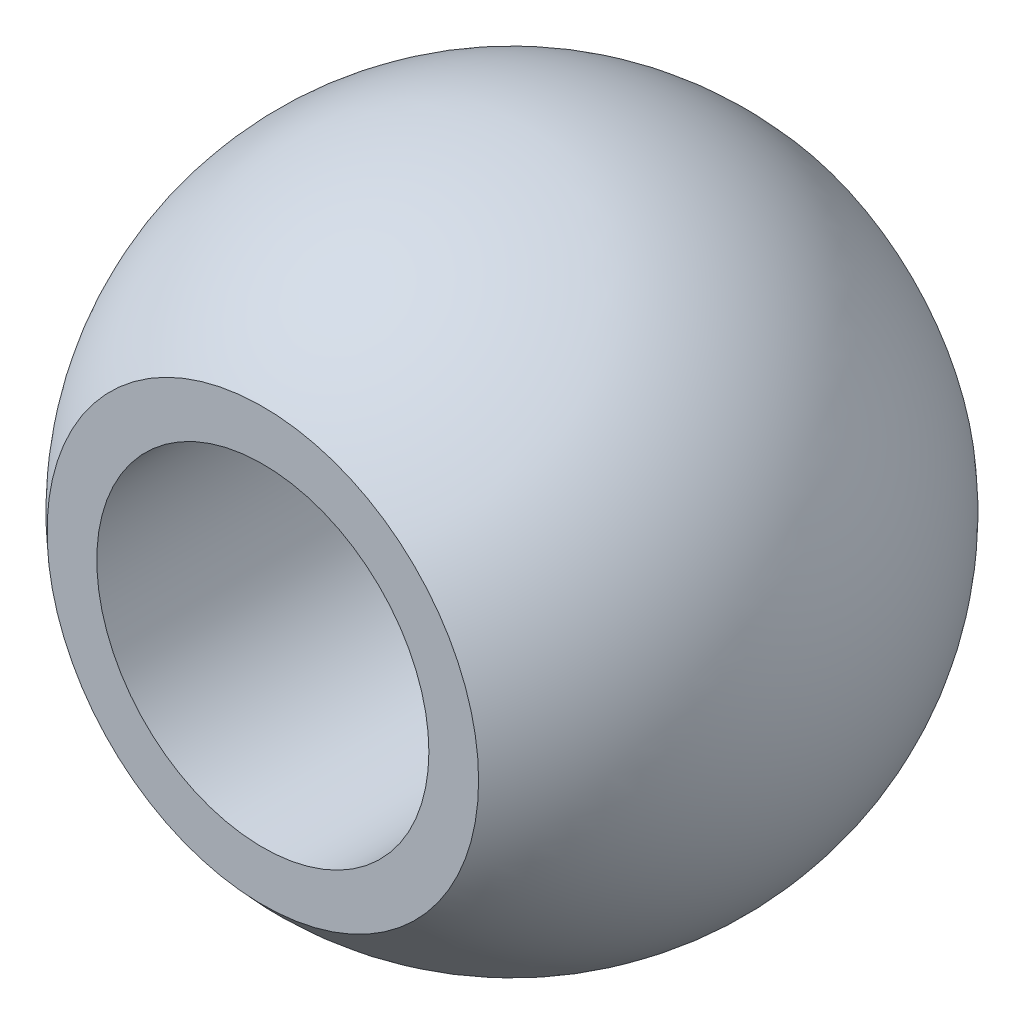
ISO-10303-21;
HEADER;
FILE_DESCRIPTION(('STEP AP214'),'2;1');
FILE_NAME('part.step','',(''),(''),'','','');
FILE_SCHEMA(('AUTOMOTIVE_DESIGN { 1 0 10303 214 1 1 1 1 }'));
ENDSEC;
DATA;
#1=APPLICATION_CONTEXT('core data for automotive mechanical design processes');
#2=APPLICATION_PROTOCOL_DEFINITION('international standard','automotive_design',2000,#1);
#3=PRODUCT_CONTEXT('',#1,'mechanical');
#4=PRODUCT('Part','Part','',(#3));
#5=PRODUCT_RELATED_PRODUCT_CATEGORY('part','',(#4));
#6=PRODUCT_DEFINITION_FORMATION('','',#4);
#7=PRODUCT_DEFINITION_CONTEXT('part definition',#1,'design');
#8=PRODUCT_DEFINITION('design','',#6,#7);
#9=PRODUCT_DEFINITION_SHAPE('','',#8);
#10=(LENGTH_UNIT() NAMED_UNIT(*) SI_UNIT(.MILLI.,.METRE.));
#11=(NAMED_UNIT(*) PLANE_ANGLE_UNIT() SI_UNIT($,.RADIAN.));
#12=(NAMED_UNIT(*) SI_UNIT($,.STERADIAN.) SOLID_ANGLE_UNIT());
#13=UNCERTAINTY_MEASURE_WITH_UNIT(LENGTH_MEASURE(1.E-05),#10,'distance_accuracy_value','');
#14=(GEOMETRIC_REPRESENTATION_CONTEXT(3) GLOBAL_UNCERTAINTY_ASSIGNED_CONTEXT((#13)) GLOBAL_UNIT_ASSIGNED_CONTEXT((#10,
#11,#12)) REPRESENTATION_CONTEXT('',''));
#15=CARTESIAN_POINT('',(0.,0.,0.));
#16=DIRECTION('',(0.,0.,1.));
#17=DIRECTION('',(1.,0.,0.));
#18=AXIS2_PLACEMENT_3D('',#15,#16,#17);
#19=CARTESIAN_POINT('',(0.,0.,0.));
#20=DIRECTION('',(0.,0.,1.));
#21=DIRECTION('',(0.,1.,0.));
#22=AXIS2_PLACEMENT_3D('',#19,#20,#21);
#23=SPHERICAL_SURFACE('',#22,7.938);
#24=CARTESIAN_POINT('',(8.88178419700125E-13,0.,5.99999999999995));
#25=DIRECTION('',(0.,0.,1.));
#26=DIRECTION('',(1.,0.,0.));
#27=AXIS2_PLACEMENT_3D('',#24,#25,#26);
#28=CIRCLE('',#27,5.19729198717948);
#29=CARTESIAN_POINT('',(5.19729198718037,0.,5.99999999999995));
#30=VERTEX_POINT('',#29);
#31=EDGE_CURVE('E50',#30,#30,#28,.T.);
#32=ORIENTED_EDGE('',*,*,#31,.F.);
#33=EDGE_LOOP('',(#32));
#34=FACE_BOUND('',#33,.T.);
#35=CARTESIAN_POINT('',(0.,0.,-6.00000000000001));
#36=DIRECTION('',(0.,0.,1.));
#37=DIRECTION('',(1.,0.,0.));
#38=AXIS2_PLACEMENT_3D('',#35,#36,#37);
#39=CIRCLE('',#38,5.19729198717948);
#40=CARTESIAN_POINT('',(5.19729198717948,0.,-6.00000000000001));
#41=VERTEX_POINT('',#40);
#42=EDGE_CURVE('E10',#41,#41,#39,.T.);
#43=ORIENTED_EDGE('',*,*,#42,.T.);
#44=EDGE_LOOP('',(#43));
#45=FACE_BOUND('',#44,.T.);
#46=ADVANCED_FACE('F36',(#34,#45),#23,.T.);
#47=CARTESIAN_POINT('',(0.,4.,-5.99999999999995));
#48=DIRECTION('',(0.,0.,1.));
#49=DIRECTION('',(1.,0.,0.));
#50=AXIS2_PLACEMENT_3D('',#47,#48,#49);
#51=PLANE('',#50);
#52=ORIENTED_EDGE('',*,*,#42,.F.);
#53=EDGE_LOOP('',(#52));
#54=FACE_BOUND('',#53,.T.);
#55=CARTESIAN_POINT('',(0.,0.,-6.00000000000001));
#56=DIRECTION('',(0.,0.,1.));
#57=DIRECTION('',(1.,0.,0.));
#58=AXIS2_PLACEMENT_3D('',#55,#56,#57);
#59=CIRCLE('',#58,4.);
#60=CARTESIAN_POINT('',(4.,0.,-6.00000000000001));
#61=VERTEX_POINT('',#60);
#62=EDGE_CURVE('E42',#61,#61,#59,.T.);
#63=ORIENTED_EDGE('',*,*,#62,.T.);
#64=EDGE_LOOP('',(#63));
#65=FACE_BOUND('',#64,.T.);
#66=ADVANCED_FACE('F59',(#54,#65),#51,.F.);
#67=CARTESIAN_POINT('',(0.,0.,31.2589553314228));
#68=DIRECTION('',(0.,0.,1.));
#69=DIRECTION('',(1.,0.,0.));
#70=AXIS2_PLACEMENT_3D('',#67,#68,#69);
#71=CYLINDRICAL_SURFACE('',#70,4.);
#72=ORIENTED_EDGE('',*,*,#62,.F.);
#73=EDGE_LOOP('',(#72));
#74=FACE_BOUND('',#73,.T.);
#75=CARTESIAN_POINT('',(8.88178419700125E-13,0.,5.99999999999995));
#76=DIRECTION('',(0.,0.,1.));
#77=DIRECTION('',(1.,0.,0.));
#78=AXIS2_PLACEMENT_3D('',#75,#76,#77);
#79=CIRCLE('',#78,4.);
#80=CARTESIAN_POINT('',(4.00000000000089,0.,5.99999999999995));
#81=VERTEX_POINT('',#80);
#82=EDGE_CURVE('E46',#81,#81,#79,.T.);
#83=ORIENTED_EDGE('',*,*,#82,.T.);
#84=EDGE_LOOP('',(#83));
#85=FACE_BOUND('',#84,.T.);
#86=ADVANCED_FACE('F62',(#74,#85),#71,.F.);
#87=CARTESIAN_POINT('',(0.,5.19729198717955,6.00000000000001));
#88=DIRECTION('',(0.,0.,-1.));
#89=DIRECTION('',(-1.,0.,0.));
#90=AXIS2_PLACEMENT_3D('',#87,#88,#89);
#91=PLANE('',#90);
#92=ORIENTED_EDGE('',*,*,#82,.F.);
#93=EDGE_LOOP('',(#92));
#94=FACE_BOUND('',#93,.T.);
#95=ORIENTED_EDGE('',*,*,#31,.T.);
#96=EDGE_LOOP('',(#95));
#97=FACE_BOUND('',#96,.T.);
#98=ADVANCED_FACE('F56',(#94,#97),#91,.F.);
#99=CLOSED_SHELL('',(#46,#66,#86,#98));
#100=MANIFOLD_SOLID_BREP('B2',#99);
#101=ADVANCED_BREP_SHAPE_REPRESENTATION('',(#18,#100),#14);
#102=SHAPE_DEFINITION_REPRESENTATION(#9,#101);
ENDSEC;
END-ISO-10303-21;
